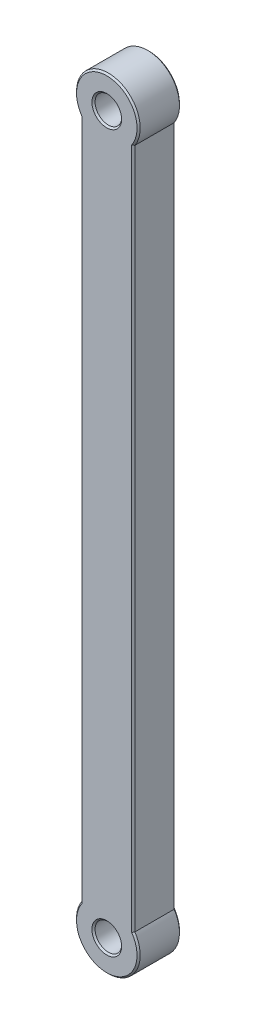
ISO-10303-21;
HEADER;
FILE_DESCRIPTION(('STEP AP214'),'2;1');
FILE_NAME('part.step','',(''),(''),'','','');
FILE_SCHEMA(('AUTOMOTIVE_DESIGN { 1 0 10303 214 1 1 1 1 }'));
ENDSEC;
DATA;
#1=APPLICATION_CONTEXT('core data for automotive mechanical design processes');
#2=APPLICATION_PROTOCOL_DEFINITION('international standard','automotive_design',2000,#1);
#3=PRODUCT_CONTEXT('',#1,'mechanical');
#4=PRODUCT('Part','Part','',(#3));
#5=PRODUCT_RELATED_PRODUCT_CATEGORY('part','',(#4));
#6=PRODUCT_DEFINITION_FORMATION('','',#4);
#7=PRODUCT_DEFINITION_CONTEXT('part definition',#1,'design');
#8=PRODUCT_DEFINITION('design','',#6,#7);
#9=PRODUCT_DEFINITION_SHAPE('','',#8);
#10=(LENGTH_UNIT() NAMED_UNIT(*) SI_UNIT(.MILLI.,.METRE.));
#11=(NAMED_UNIT(*) PLANE_ANGLE_UNIT() SI_UNIT($,.RADIAN.));
#12=(NAMED_UNIT(*) SI_UNIT($,.STERADIAN.) SOLID_ANGLE_UNIT());
#13=UNCERTAINTY_MEASURE_WITH_UNIT(LENGTH_MEASURE(1.E-05),#10,'distance_accuracy_value','');
#14=(GEOMETRIC_REPRESENTATION_CONTEXT(3) GLOBAL_UNCERTAINTY_ASSIGNED_CONTEXT((#13)) GLOBAL_UNIT_ASSIGNED_CONTEXT((#10,
#11,#12)) REPRESENTATION_CONTEXT('',''));
#15=CARTESIAN_POINT('',(0.,0.,0.));
#16=DIRECTION('',(0.,0.,1.));
#17=DIRECTION('',(1.,0.,0.));
#18=AXIS2_PLACEMENT_3D('',#15,#16,#17);
#19=CARTESIAN_POINT('',(5.,0.,8.));
#20=DIRECTION('',(-1.,0.,0.));
#21=DIRECTION('',(0.,0.,1.));
#22=AXIS2_PLACEMENT_3D('',#19,#20,#21);
#23=PLANE('',#22);
#24=DIRECTION('',(0.,0.,-1.));
#25=VECTOR('',#24,1.);
#26=CARTESIAN_POINT('',(5.,3.3166247903554,24.9705627484771));
#27=LINE('',#26,#25);
#28=CARTESIAN_POINT('',(5.,3.3166247903554,0.299999999999995));
#29=VERTEX_POINT('',#28);
#30=CARTESIAN_POINT('',(5.,3.3166247903554,7.69999999999999));
#31=VERTEX_POINT('',#30);
#32=EDGE_CURVE('E139',#29,#31,#27,.F.);
#33=ORIENTED_EDGE('',*,*,#32,.F.);
#34=DIRECTION('',(0.,1.,0.));
#35=VECTOR('',#34,1.);
#36=CARTESIAN_POINT('',(5.,0.,0.299999999999995));
#37=LINE('',#36,#35);
#38=CARTESIAN_POINT('',(5.,131.683375209645,0.299999999999995));
#39=VERTEX_POINT('',#38);
#40=EDGE_CURVE('E124',#29,#39,#37,.T.);
#41=ORIENTED_EDGE('',*,*,#40,.T.);
#42=DIRECTION('',(0.,0.,-1.));
#43=VECTOR('',#42,1.);
#44=CARTESIAN_POINT('',(5.,131.683375209645,24.9705627484771));
#45=LINE('',#44,#43);
#46=CARTESIAN_POINT('',(5.,131.683375209645,7.69999999999999));
#47=VERTEX_POINT('',#46);
#48=EDGE_CURVE('E150',#47,#39,#45,.T.);
#49=ORIENTED_EDGE('',*,*,#48,.F.);
#50=DIRECTION('',(0.,-1.,0.));
#51=VECTOR('',#50,1.);
#52=CARTESIAN_POINT('',(5.,3.3166247903554,7.69999999999999));
#53=LINE('',#52,#51);
#54=EDGE_CURVE('E133',#47,#31,#53,.T.);
#55=ORIENTED_EDGE('',*,*,#54,.T.);
#56=EDGE_LOOP('',(#33,#41,#49,#55));
#57=FACE_BOUND('',#56,.T.);
#58=ADVANCED_FACE('F39',(#57),#23,.F.);
#59=CARTESIAN_POINT('',(-5.,0.,8.));
#60=DIRECTION('',(1.,0.,0.));
#61=DIRECTION('',(0.,0.,-1.));
#62=AXIS2_PLACEMENT_3D('',#59,#60,#61);
#63=PLANE('',#62);
#64=DIRECTION('',(0.,0.,-1.));
#65=VECTOR('',#64,1.);
#66=CARTESIAN_POINT('',(-5.,131.683375209645,24.9705627484771));
#67=LINE('',#66,#65);
#68=CARTESIAN_POINT('',(-5.,131.683375209645,0.299999999999995));
#69=VERTEX_POINT('',#68);
#70=CARTESIAN_POINT('',(-5.,131.683375209645,7.69999999999999));
#71=VERTEX_POINT('',#70);
#72=EDGE_CURVE('E437',#69,#71,#67,.F.);
#73=ORIENTED_EDGE('',*,*,#72,.F.);
#74=DIRECTION('',(0.,-1.,0.));
#75=VECTOR('',#74,1.);
#76=CARTESIAN_POINT('',(-5.,0.,0.299999999999995));
#77=LINE('',#76,#75);
#78=CARTESIAN_POINT('',(-5.,3.3166247903554,0.299999999999995));
#79=VERTEX_POINT('',#78);
#80=EDGE_CURVE('E172',#69,#79,#77,.T.);
#81=ORIENTED_EDGE('',*,*,#80,.T.);
#82=DIRECTION('',(0.,0.,-1.));
#83=VECTOR('',#82,1.);
#84=CARTESIAN_POINT('',(-5.,3.3166247903554,24.9705627484771));
#85=LINE('',#84,#83);
#86=CARTESIAN_POINT('',(-5.,3.3166247903554,7.69999999999999));
#87=VERTEX_POINT('',#86);
#88=EDGE_CURVE('E141',#87,#79,#85,.T.);
#89=ORIENTED_EDGE('',*,*,#88,.F.);
#90=DIRECTION('',(0.,1.,0.));
#91=VECTOR('',#90,1.);
#92=CARTESIAN_POINT('',(-5.,131.683375209645,7.69999999999999));
#93=LINE('',#92,#91);
#94=EDGE_CURVE('E170',#87,#71,#93,.T.);
#95=ORIENTED_EDGE('',*,*,#94,.T.);
#96=EDGE_LOOP('',(#73,#81,#89,#95));
#97=FACE_BOUND('',#96,.T.);
#98=ADVANCED_FACE('F313',(#97),#63,.F.);
#99=CARTESIAN_POINT('',(0.,0.,8.));
#100=DIRECTION('',(0.,0.,1.));
#101=DIRECTION('',(1.,0.,0.));
#102=AXIS2_PLACEMENT_3D('',#99,#100,#101);
#103=PLANE('',#102);
#104=CARTESIAN_POINT('',(0.,0.,8.));
#105=DIRECTION('',(0.,0.,1.));
#106=DIRECTION('',(1.,0.,0.));
#107=AXIS2_PLACEMENT_3D('',#104,#105,#106);
#108=CIRCLE('',#107,5.69999999999998);
#109=CARTESIAN_POINT('',(-4.69999999999998,3.22490309931942,8.));
#110=VERTEX_POINT('',#109);
#111=CARTESIAN_POINT('',(4.69999999999998,3.22490309931942,8.));
#112=VERTEX_POINT('',#111);
#113=EDGE_CURVE('E55',#110,#112,#108,.T.);
#114=ORIENTED_EDGE('',*,*,#113,.T.);
#115=DIRECTION('',(0.,1.,0.));
#116=VECTOR('',#115,1.);
#117=CARTESIAN_POINT('',(4.69999999999998,131.683375209645,8.));
#118=LINE('',#117,#116);
#119=CARTESIAN_POINT('',(4.69999999999998,131.775096900681,8.));
#120=VERTEX_POINT('',#119);
#121=EDGE_CURVE('E11',#112,#120,#118,.T.);
#122=ORIENTED_EDGE('',*,*,#121,.T.);
#123=CARTESIAN_POINT('',(0.,135.,8.));
#124=DIRECTION('',(0.,0.,1.));
#125=DIRECTION('',(1.,0.,0.));
#126=AXIS2_PLACEMENT_3D('',#123,#124,#125);
#127=CIRCLE('',#126,5.69999999999998);
#128=CARTESIAN_POINT('',(-4.69999999999998,131.775096900681,8.));
#129=VERTEX_POINT('',#128);
#130=EDGE_CURVE('E192',#120,#129,#127,.T.);
#131=ORIENTED_EDGE('',*,*,#130,.T.);
#132=DIRECTION('',(0.,-1.,0.));
#133=VECTOR('',#132,1.);
#134=CARTESIAN_POINT('',(-4.69999999999998,3.3166247903554,8.));
#135=LINE('',#134,#133);
#136=EDGE_CURVE('E66',#129,#110,#135,.T.);
#137=ORIENTED_EDGE('',*,*,#136,.T.);
#138=EDGE_LOOP('',(#114,#122,#131,#137));
#139=FACE_BOUND('',#138,.T.);
#140=CARTESIAN_POINT('',(0.,0.,8.));
#141=DIRECTION('',(0.,0.,1.));
#142=DIRECTION('',(1.,0.,0.));
#143=AXIS2_PLACEMENT_3D('',#140,#141,#142);
#144=CIRCLE('',#143,2.79999999999998);
#145=CARTESIAN_POINT('',(2.79999999999998,0.,8.));
#146=VERTEX_POINT('',#145);
#147=EDGE_CURVE('E189',#146,#146,#144,.F.);
#148=ORIENTED_EDGE('',*,*,#147,.T.);
#149=EDGE_LOOP('',(#148));
#150=FACE_BOUND('',#149,.T.);
#151=CARTESIAN_POINT('',(3.06005221162309E-12,135.,8.));
#152=DIRECTION('',(0.,0.,1.));
#153=DIRECTION('',(1.,0.,0.));
#154=AXIS2_PLACEMENT_3D('',#151,#152,#153);
#155=CIRCLE('',#154,2.8000000000018);
#156=CARTESIAN_POINT('',(2.80000000000486,135.,8.));
#157=VERTEX_POINT('',#156);
#158=EDGE_CURVE('E186',#157,#157,#155,.F.);
#159=ORIENTED_EDGE('',*,*,#158,.T.);
#160=EDGE_LOOP('',(#159));
#161=FACE_BOUND('',#160,.T.);
#162=ADVANCED_FACE('F317',(#139,#150,#161),#103,.T.);
#163=CARTESIAN_POINT('',(0.,0.,0.));
#164=DIRECTION('',(0.,0.,1.));
#165=DIRECTION('',(1.,0.,0.));
#166=AXIS2_PLACEMENT_3D('',#163,#164,#165);
#167=PLANE('',#166);
#168=DIRECTION('',(0.,-1.,0.));
#169=VECTOR('',#168,1.);
#170=CARTESIAN_POINT('',(4.70000000000001,0.,0.));
#171=LINE('',#170,#169);
#172=CARTESIAN_POINT('',(4.7,131.775096900681,0.));
#173=VERTEX_POINT('',#172);
#174=CARTESIAN_POINT('',(4.70000000000001,3.22490309931942,0.));
#175=VERTEX_POINT('',#174);
#176=EDGE_CURVE('E163',#173,#175,#171,.T.);
#177=ORIENTED_EDGE('',*,*,#176,.T.);
#178=CARTESIAN_POINT('',(0.,0.,0.));
#179=DIRECTION('',(0.,0.,1.));
#180=DIRECTION('',(1.,0.,0.));
#181=AXIS2_PLACEMENT_3D('',#178,#179,#180);
#182=CIRCLE('',#181,5.70000000000001);
#183=CARTESIAN_POINT('',(-4.70000000000001,3.22490309931942,0.));
#184=VERTEX_POINT('',#183);
#185=EDGE_CURVE('E118',#175,#184,#182,.F.);
#186=ORIENTED_EDGE('',*,*,#185,.T.);
#187=DIRECTION('',(0.,1.,0.));
#188=VECTOR('',#187,1.);
#189=CARTESIAN_POINT('',(-4.70000000000001,0.,0.));
#190=LINE('',#189,#188);
#191=CARTESIAN_POINT('',(-4.70000000000001,131.775096900681,0.));
#192=VERTEX_POINT('',#191);
#193=EDGE_CURVE('E159',#184,#192,#190,.T.);
#194=ORIENTED_EDGE('',*,*,#193,.T.);
#195=CARTESIAN_POINT('',(0.,135.,0.));
#196=DIRECTION('',(0.,0.,1.));
#197=DIRECTION('',(1.,0.,0.));
#198=AXIS2_PLACEMENT_3D('',#195,#196,#197);
#199=CIRCLE('',#198,5.70000000000001);
#200=EDGE_CURVE('E161',#192,#173,#199,.F.);
#201=ORIENTED_EDGE('',*,*,#200,.T.);
#202=EDGE_LOOP('',(#177,#186,#194,#201));
#203=FACE_BOUND('',#202,.T.);
#204=CARTESIAN_POINT('',(0.,0.,0.));
#205=DIRECTION('',(0.,0.,1.));
#206=DIRECTION('',(1.,0.,0.));
#207=AXIS2_PLACEMENT_3D('',#204,#205,#206);
#208=CIRCLE('',#207,2.80000000000001);
#209=CARTESIAN_POINT('',(2.80000000000001,0.,0.));
#210=VERTEX_POINT('',#209);
#211=EDGE_CURVE('E156',#210,#210,#208,.T.);
#212=ORIENTED_EDGE('',*,*,#211,.T.);
#213=EDGE_LOOP('',(#212));
#214=FACE_BOUND('',#213,.T.);
#215=CARTESIAN_POINT('',(3.06005221162309E-12,135.,0.));
#216=DIRECTION('',(0.,0.,1.));
#217=DIRECTION('',(1.,0.,0.));
#218=AXIS2_PLACEMENT_3D('',#215,#216,#217);
#219=CIRCLE('',#218,2.80000000000181);
#220=CARTESIAN_POINT('',(2.80000000000488,135.,0.));
#221=VERTEX_POINT('',#220);
#222=EDGE_CURVE('E143',#221,#221,#219,.T.);
#223=ORIENTED_EDGE('',*,*,#222,.T.);
#224=EDGE_LOOP('',(#223));
#225=FACE_BOUND('',#224,.T.);
#226=ADVANCED_FACE('F321',(#203,#214,#225),#167,.F.);
#227=CARTESIAN_POINT('',(0.,0.,24.9705627484771));
#228=DIRECTION('',(0.,0.,-1.));
#229=DIRECTION('',(-1.,0.,0.));
#230=AXIS2_PLACEMENT_3D('',#227,#228,#229);
#231=CYLINDRICAL_SURFACE('',#230,6.);
#232=ORIENTED_EDGE('',*,*,#88,.T.);
#233=CARTESIAN_POINT('',(0.,0.,0.299999999999995));
#234=DIRECTION('',(0.,0.,1.));
#235=DIRECTION('',(1.,0.,0.));
#236=AXIS2_PLACEMENT_3D('',#233,#234,#235);
#237=CIRCLE('',#236,6.);
#238=EDGE_CURVE('E116',#79,#29,#237,.T.);
#239=ORIENTED_EDGE('',*,*,#238,.T.);
#240=ORIENTED_EDGE('',*,*,#32,.T.);
#241=CARTESIAN_POINT('',(0.,0.,7.69999999999999));
#242=DIRECTION('',(0.,0.,1.));
#243=DIRECTION('',(1.,0.,0.));
#244=AXIS2_PLACEMENT_3D('',#241,#242,#243);
#245=CIRCLE('',#244,6.);
#246=EDGE_CURVE('E144',#31,#87,#245,.F.);
#247=ORIENTED_EDGE('',*,*,#246,.T.);
#248=EDGE_LOOP('',(#232,#239,#240,#247));
#249=FACE_BOUND('',#248,.T.);
#250=ADVANCED_FACE('F138',(#249),#231,.T.);
#251=CARTESIAN_POINT('',(0.,135.,24.9705627484771));
#252=DIRECTION('',(0.,0.,-1.));
#253=DIRECTION('',(-1.,0.,0.));
#254=AXIS2_PLACEMENT_3D('',#251,#252,#253);
#255=CYLINDRICAL_SURFACE('',#254,6.);
#256=ORIENTED_EDGE('',*,*,#48,.T.);
#257=CARTESIAN_POINT('',(0.,135.,0.299999999999995));
#258=DIRECTION('',(0.,0.,1.));
#259=DIRECTION('',(1.,0.,0.));
#260=AXIS2_PLACEMENT_3D('',#257,#258,#259);
#261=CIRCLE('',#260,6.);
#262=EDGE_CURVE('E168',#39,#69,#261,.T.);
#263=ORIENTED_EDGE('',*,*,#262,.T.);
#264=ORIENTED_EDGE('',*,*,#72,.T.);
#265=CARTESIAN_POINT('',(0.,135.,7.69999999999999));
#266=DIRECTION('',(0.,0.,1.));
#267=DIRECTION('',(1.,0.,0.));
#268=AXIS2_PLACEMENT_3D('',#265,#266,#267);
#269=CIRCLE('',#268,6.);
#270=EDGE_CURVE('E132',#71,#47,#269,.F.);
#271=ORIENTED_EDGE('',*,*,#270,.T.);
#272=EDGE_LOOP('',(#256,#263,#264,#271));
#273=FACE_BOUND('',#272,.T.);
#274=ADVANCED_FACE('F329',(#273),#255,.T.);
#275=CARTESIAN_POINT('',(0.,0.,8.));
#276=DIRECTION('',(0.,0.,-1.));
#277=DIRECTION('',(-1.,0.,0.));
#278=AXIS2_PLACEMENT_3D('',#275,#276,#277);
#279=CYLINDRICAL_SURFACE('',#278,2.5);
#280=CARTESIAN_POINT('',(0.,0.,0.300000000000019));
#281=DIRECTION('',(0.,0.,1.));
#282=DIRECTION('',(1.,0.,0.));
#283=AXIS2_PLACEMENT_3D('',#280,#281,#282);
#284=CIRCLE('',#283,2.5);
#285=CARTESIAN_POINT('',(2.5,0.,0.300000000000019));
#286=VERTEX_POINT('',#285);
#287=EDGE_CURVE('E177',#286,#286,#284,.F.);
#288=ORIENTED_EDGE('',*,*,#287,.T.);
#289=EDGE_LOOP('',(#288));
#290=FACE_BOUND('',#289,.T.);
#291=CARTESIAN_POINT('',(0.,0.,7.70000000000001));
#292=DIRECTION('',(0.,0.,1.));
#293=DIRECTION('',(1.,0.,0.));
#294=AXIS2_PLACEMENT_3D('',#291,#292,#293);
#295=CIRCLE('',#294,2.5);
#296=CARTESIAN_POINT('',(2.5,0.,7.70000000000001));
#297=VERTEX_POINT('',#296);
#298=EDGE_CURVE('E174',#297,#297,#295,.T.);
#299=ORIENTED_EDGE('',*,*,#298,.T.);
#300=EDGE_LOOP('',(#299));
#301=FACE_BOUND('',#300,.T.);
#302=ADVANCED_FACE('F332',(#290,#301),#279,.F.);
#303=CARTESIAN_POINT('',(3.06005221162309E-12,135.,8.));
#304=DIRECTION('',(0.,0.,-1.));
#305=DIRECTION('',(-1.,0.,0.));
#306=AXIS2_PLACEMENT_3D('',#303,#304,#305);
#307=CYLINDRICAL_SURFACE('',#306,2.50000000000182);
#308=CARTESIAN_POINT('',(3.06005221162309E-12,135.,0.300000000000003));
#309=DIRECTION('',(0.,0.,1.));
#310=DIRECTION('',(1.,0.,0.));
#311=AXIS2_PLACEMENT_3D('',#308,#309,#310);
#312=CIRCLE('',#311,2.50000000000182);
#313=CARTESIAN_POINT('',(2.50000000000488,135.,0.300000000000003));
#314=VERTEX_POINT('',#313);
#315=EDGE_CURVE('E183',#314,#314,#312,.F.);
#316=ORIENTED_EDGE('',*,*,#315,.T.);
#317=EDGE_LOOP('',(#316));
#318=FACE_BOUND('',#317,.T.);
#319=CARTESIAN_POINT('',(3.06005221162309E-12,135.,7.70000000000002));
#320=DIRECTION('',(0.,0.,1.));
#321=DIRECTION('',(1.,0.,0.));
#322=AXIS2_PLACEMENT_3D('',#319,#320,#321);
#323=CIRCLE('',#322,2.50000000000182);
#324=CARTESIAN_POINT('',(2.50000000000488,135.,7.70000000000002));
#325=VERTEX_POINT('',#324);
#326=EDGE_CURVE('E180',#325,#325,#323,.T.);
#327=ORIENTED_EDGE('',*,*,#326,.T.);
#328=EDGE_LOOP('',(#327));
#329=FACE_BOUND('',#328,.T.);
#330=ADVANCED_FACE('F239',(#318,#329),#307,.F.);
#331=CARTESIAN_POINT('',(0.,135.,0.299999999999995));
#332=DIRECTION('',(0.,0.,1.));
#333=DIRECTION('',(1.,0.,0.));
#334=AXIS2_PLACEMENT_3D('',#331,#332,#333);
#335=CONICAL_SURFACE('',#334,6.,0.785398163397443);
#336=CARTESIAN_POINT('',(5.,131.683375209645,0.299999999999995));
#337=CARTESIAN_POINT('',(4.94996870034109,131.698457392154,0.249968700341085));
#338=CARTESIAN_POINT('',(4.89995305185478,131.713641957245,0.199953051854774));
#339=CARTESIAN_POINT('',(4.79995305185142,131.744215854235,0.0999530518514099));
#340=CARTESIAN_POINT('',(4.74996870033773,131.759605186156,0.0499687003377232));
#341=CARTESIAN_POINT('',(4.70000000000001,131.775096900681,0.));
#342=B_SPLINE_CURVE_WITH_KNOTS('',3,(#336,#337,#338,#339,#340,#341),.UNSPECIFIED.,.F.,.F.,(4,2,
4),(0.,0.217032971771938,0.434065966878987),.UNSPECIFIED.);
#343=EDGE_CURVE('E127',#173,#39,#342,.F.);
#344=ORIENTED_EDGE('',*,*,#343,.F.);
#345=ORIENTED_EDGE('',*,*,#200,.F.);
#346=CARTESIAN_POINT('',(-5.,131.683375209645,0.299999999999995));
#347=CARTESIAN_POINT('',(-4.94996870034109,131.698457392154,0.249968700341085));
#348=CARTESIAN_POINT('',(-4.89995305185478,131.713641957245,0.199953051854773));
#349=CARTESIAN_POINT('',(-4.79995305185142,131.744215854235,0.0999530518514076));
#350=CARTESIAN_POINT('',(-4.74996870033773,131.759605186156,0.0499687003377202));
#351=CARTESIAN_POINT('',(-4.7,131.775096900681,0.));
#352=B_SPLINE_CURVE_WITH_KNOTS('',3,(#346,#347,#348,#349,#350,#351),.UNSPECIFIED.,.F.,.F.,(4,2,
4),(0.,0.21703297177194,0.434065966878992),.UNSPECIFIED.);
#353=EDGE_CURVE('E226',#69,#192,#352,.T.);
#354=ORIENTED_EDGE('',*,*,#353,.F.);
#355=ORIENTED_EDGE('',*,*,#262,.F.);
#356=EDGE_LOOP('',(#344,#345,#354,#355));
#357=FACE_BOUND('',#356,.T.);
#358=ADVANCED_FACE('F233',(#357),#335,.T.);
#359=CARTESIAN_POINT('',(-5.,0.,0.299999999999995));
#360=DIRECTION('',(0.707106781186547,0.,0.707106781186547));
#361=DIRECTION('',(0.,-1.,0.));
#362=AXIS2_PLACEMENT_3D('',#359,#360,#361);
#363=PLANE('',#362);
#364=ORIENTED_EDGE('',*,*,#353,.T.);
#365=ORIENTED_EDGE('',*,*,#193,.F.);
#366=CARTESIAN_POINT('',(-4.7,3.22490309931942,0.));
#367=CARTESIAN_POINT('',(-4.74996870033773,3.24039481384446,0.0499687003377218));
#368=CARTESIAN_POINT('',(-4.79995305185141,3.25578414576537,0.0999530518514078));
#369=CARTESIAN_POINT('',(-4.89995305185478,3.28635804275535,0.199953051854771));
#370=CARTESIAN_POINT('',(-4.94996870034109,3.30154260784643,0.249968700341083));
#371=CARTESIAN_POINT('',(-5.,3.3166247903554,0.299999999999994));
#372=B_SPLINE_CURVE_WITH_KNOTS('',3,(#366,#367,#368,#369,#370,#371),.UNSPECIFIED.,.F.,.F.,(4,2,
4),(0.,0.217032995107051,0.434065966878991),.UNSPECIFIED.);
#373=EDGE_CURVE('E121',#79,#184,#372,.F.);
#374=ORIENTED_EDGE('',*,*,#373,.F.);
#375=ORIENTED_EDGE('',*,*,#80,.F.);
#376=EDGE_LOOP('',(#364,#365,#374,#375));
#377=FACE_BOUND('',#376,.T.);
#378=ADVANCED_FACE('F217',(#377),#363,.F.);
#379=CARTESIAN_POINT('',(5.,0.,0.299999999999995));
#380=DIRECTION('',(-0.707106781186547,0.,0.707106781186547));
#381=DIRECTION('',(0.,1.,0.));
#382=AXIS2_PLACEMENT_3D('',#379,#380,#381);
#383=PLANE('',#382);
#384=ORIENTED_EDGE('',*,*,#343,.T.);
#385=ORIENTED_EDGE('',*,*,#40,.F.);
#386=CARTESIAN_POINT('',(5.,3.3166247903554,0.299999999999995));
#387=CARTESIAN_POINT('',(4.94996870034109,3.30154260784642,0.249968700341084));
#388=CARTESIAN_POINT('',(4.89995305185478,3.28635804275535,0.199953051854772));
#389=CARTESIAN_POINT('',(4.79995305185142,3.25578414576538,0.0999530518514081));
#390=CARTESIAN_POINT('',(4.74996870033773,3.24039481384446,0.0499687003377215));
#391=CARTESIAN_POINT('',(4.70000000000001,3.22490309931943,0.));
#392=B_SPLINE_CURVE_WITH_KNOTS('',3,(#386,#387,#388,#389,#390,#391),.UNSPECIFIED.,.F.,.F.,(4,2,
4),(0.,0.217032971771939,0.434065966878991),.UNSPECIFIED.);
#393=EDGE_CURVE('E112',#175,#29,#392,.F.);
#394=ORIENTED_EDGE('',*,*,#393,.F.);
#395=ORIENTED_EDGE('',*,*,#176,.F.);
#396=EDGE_LOOP('',(#384,#385,#394,#395));
#397=FACE_BOUND('',#396,.T.);
#398=ADVANCED_FACE('F125',(#397),#383,.F.);
#399=CARTESIAN_POINT('',(0.,0.,0.299999999999995));
#400=DIRECTION('',(0.,0.,1.));
#401=DIRECTION('',(1.,0.,0.));
#402=AXIS2_PLACEMENT_3D('',#399,#400,#401);
#403=CONICAL_SURFACE('',#402,6.,0.785398163397448);
#404=ORIENTED_EDGE('',*,*,#373,.T.);
#405=ORIENTED_EDGE('',*,*,#185,.F.);
#406=ORIENTED_EDGE('',*,*,#393,.T.);
#407=ORIENTED_EDGE('',*,*,#238,.F.);
#408=EDGE_LOOP('',(#404,#405,#406,#407));
#409=FACE_BOUND('',#408,.T.);
#410=ADVANCED_FACE('F114',(#409),#403,.T.);
#411=CARTESIAN_POINT('',(0.,0.,0.300000000000019));
#412=DIRECTION('',(0.,0.,-1.));
#413=DIRECTION('',(-1.,0.,0.));
#414=AXIS2_PLACEMENT_3D('',#411,#412,#413);
#415=CONICAL_SURFACE('',#414,2.5,0.785398163397434);
#416=ORIENTED_EDGE('',*,*,#211,.F.);
#417=EDGE_LOOP('',(#416));
#418=FACE_BOUND('',#417,.T.);
#419=ORIENTED_EDGE('',*,*,#287,.F.);
#420=EDGE_LOOP('',(#419));
#421=FACE_BOUND('',#420,.T.);
#422=ADVANCED_FACE('F242',(#418,#421),#415,.F.);
#423=CARTESIAN_POINT('',(3.06005221162309E-12,135.,0.300000000000003));
#424=DIRECTION('',(0.,0.,-1.));
#425=DIRECTION('',(-1.,0.,0.));
#426=AXIS2_PLACEMENT_3D('',#423,#424,#425);
#427=CONICAL_SURFACE('',#426,2.50000000000182,0.785398163397435);
#428=ORIENTED_EDGE('',*,*,#222,.F.);
#429=EDGE_LOOP('',(#428));
#430=FACE_BOUND('',#429,.T.);
#431=ORIENTED_EDGE('',*,*,#315,.F.);
#432=EDGE_LOOP('',(#431));
#433=FACE_BOUND('',#432,.T.);
#434=ADVANCED_FACE('F249',(#430,#433),#427,.F.);
#435=CARTESIAN_POINT('',(-4.69999999999998,0.,8.));
#436=DIRECTION('',(-0.707106781186535,0.,0.70710678118656));
#437=DIRECTION('',(0.,1.,0.));
#438=AXIS2_PLACEMENT_3D('',#435,#436,#437);
#439=PLANE('',#438);
#440=CARTESIAN_POINT('',(-5.,131.683375209645,7.69999999999999));
#441=CARTESIAN_POINT('',(-4.94996870034108,131.698457392154,7.7500312996589));
#442=CARTESIAN_POINT('',(-4.89995305185477,131.713641957245,7.80004694814522));
#443=CARTESIAN_POINT('',(-4.7999530518514,131.744215854235,7.90004694814859));
#444=CARTESIAN_POINT('',(-4.74996870033771,131.759605186156,7.95003129966228));
#445=CARTESIAN_POINT('',(-4.69999999999998,131.775096900681,8.));
#446=B_SPLINE_CURVE_WITH_KNOTS('',3,(#440,#441,#442,#443,#444,#445),.UNSPECIFIED.,.F.,.F.,(4,2,
4),(0.,0.217032971771958,0.434065966879024),.UNSPECIFIED.);
#447=EDGE_CURVE('E283',#71,#129,#446,.T.);
#448=ORIENTED_EDGE('',*,*,#447,.F.);
#449=ORIENTED_EDGE('',*,*,#94,.F.);
#450=CARTESIAN_POINT('',(-5.,3.3166247903554,7.69999999999999));
#451=CARTESIAN_POINT('',(-4.94996870034109,3.30154260784642,7.7500312996589));
#452=CARTESIAN_POINT('',(-4.89995305185477,3.28635804275535,7.80004694814522));
#453=CARTESIAN_POINT('',(-4.7999530518514,3.25578414576537,7.90004694814859));
#454=CARTESIAN_POINT('',(-4.74996870033771,3.24039481384445,7.95003129966228));
#455=CARTESIAN_POINT('',(-4.69999999999998,3.22490309931942,8.));
#456=B_SPLINE_CURVE_WITH_KNOTS('',3,(#450,#451,#452,#453,#454,#455),.UNSPECIFIED.,.F.,.F.,(4,2,
4),(0.,0.217032971771955,0.434065966879023),.UNSPECIFIED.);
#457=EDGE_CURVE('E44',#110,#87,#456,.F.);
#458=ORIENTED_EDGE('',*,*,#457,.F.);
#459=ORIENTED_EDGE('',*,*,#136,.F.);
#460=EDGE_LOOP('',(#448,#449,#458,#459));
#461=FACE_BOUND('',#460,.T.);
#462=ADVANCED_FACE('F256',(#461),#439,.T.);
#463=CARTESIAN_POINT('',(0.,0.,8.));
#464=DIRECTION('',(0.,0.,-1.));
#465=DIRECTION('',(-1.,0.,0.));
#466=AXIS2_PLACEMENT_3D('',#463,#464,#465);
#467=CONICAL_SURFACE('',#466,5.69999999999998,0.785398163397466);
#468=ORIENTED_EDGE('',*,*,#457,.T.);
#469=ORIENTED_EDGE('',*,*,#246,.F.);
#470=CARTESIAN_POINT('',(5.,3.3166247903554,7.69999999999999));
#471=CARTESIAN_POINT('',(4.94996870034109,3.30154260784642,7.7500312996589));
#472=CARTESIAN_POINT('',(4.89995305185477,3.28635804275535,7.80004694814522));
#473=CARTESIAN_POINT('',(4.7999530518514,3.25578414576537,7.90004694814859));
#474=CARTESIAN_POINT('',(4.74996870033771,3.24039481384445,7.95003129966228));
#475=CARTESIAN_POINT('',(4.69999999999998,3.22490309931942,8.));
#476=B_SPLINE_CURVE_WITH_KNOTS('',3,(#470,#471,#472,#473,#474,#475),.UNSPECIFIED.,.F.,.F.,(4,2,
4),(0.,0.217032971771955,0.434065966879023),.UNSPECIFIED.);
#477=EDGE_CURVE('E278',#112,#31,#476,.F.);
#478=ORIENTED_EDGE('',*,*,#477,.F.);
#479=ORIENTED_EDGE('',*,*,#113,.F.);
#480=EDGE_LOOP('',(#468,#469,#478,#479));
#481=FACE_BOUND('',#480,.T.);
#482=ADVANCED_FACE('F289',(#481),#467,.T.);
#483=CARTESIAN_POINT('',(0.,135.,8.));
#484=DIRECTION('',(0.,0.,-1.));
#485=DIRECTION('',(-1.,0.,0.));
#486=AXIS2_PLACEMENT_3D('',#483,#484,#485);
#487=CONICAL_SURFACE('',#486,5.69999999999998,0.78539816339746);
#488=ORIENTED_EDGE('',*,*,#447,.T.);
#489=ORIENTED_EDGE('',*,*,#130,.F.);
#490=CARTESIAN_POINT('',(4.69999999999998,131.775096900681,8.));
#491=CARTESIAN_POINT('',(4.74996870033771,131.759605186156,7.95003129966228));
#492=CARTESIAN_POINT('',(4.7999530518514,131.744215854235,7.90004694814859));
#493=CARTESIAN_POINT('',(4.89995305185477,131.713641957245,7.80004694814522));
#494=CARTESIAN_POINT('',(4.94996870034109,131.698457392154,7.7500312996589));
#495=CARTESIAN_POINT('',(5.,131.683375209645,7.69999999999999));
#496=B_SPLINE_CURVE_WITH_KNOTS('',3,(#490,#491,#492,#493,#494,#495),.UNSPECIFIED.,.F.,.F.,(4,2,
4),(0.,0.217032995107069,0.434065966879028),.UNSPECIFIED.);
#497=EDGE_CURVE('E272',#47,#120,#496,.F.);
#498=ORIENTED_EDGE('',*,*,#497,.F.);
#499=ORIENTED_EDGE('',*,*,#270,.F.);
#500=EDGE_LOOP('',(#488,#489,#498,#499));
#501=FACE_BOUND('',#500,.T.);
#502=ADVANCED_FACE('F268',(#501),#487,.T.);
#503=CARTESIAN_POINT('',(4.69999999999998,0.,8.));
#504=DIRECTION('',(0.707106781186535,0.,0.70710678118656));
#505=DIRECTION('',(0.,-1.,0.));
#506=AXIS2_PLACEMENT_3D('',#503,#504,#505);
#507=PLANE('',#506);
#508=ORIENTED_EDGE('',*,*,#477,.T.);
#509=ORIENTED_EDGE('',*,*,#54,.F.);
#510=ORIENTED_EDGE('',*,*,#497,.T.);
#511=ORIENTED_EDGE('',*,*,#121,.F.);
#512=EDGE_LOOP('',(#508,#509,#510,#511));
#513=FACE_BOUND('',#512,.T.);
#514=ADVANCED_FACE('F259',(#513),#507,.T.);
#515=CARTESIAN_POINT('',(0.,0.,8.));
#516=DIRECTION('',(0.,0.,1.));
#517=DIRECTION('',(1.,0.,0.));
#518=AXIS2_PLACEMENT_3D('',#515,#516,#517);
#519=CONICAL_SURFACE('',#518,2.79999999999998,0.785398163397434);
#520=ORIENTED_EDGE('',*,*,#298,.F.);
#521=EDGE_LOOP('',(#520));
#522=FACE_BOUND('',#521,.T.);
#523=ORIENTED_EDGE('',*,*,#147,.F.);
#524=EDGE_LOOP('',(#523));
#525=FACE_BOUND('',#524,.T.);
#526=ADVANCED_FACE('F267',(#522,#525),#519,.F.);
#527=CARTESIAN_POINT('',(3.06005221162309E-12,135.,8.));
#528=DIRECTION('',(0.,0.,1.));
#529=DIRECTION('',(1.,0.,0.));
#530=AXIS2_PLACEMENT_3D('',#527,#528,#529);
#531=CONICAL_SURFACE('',#530,2.8000000000018,0.785398163397458);
#532=ORIENTED_EDGE('',*,*,#326,.F.);
#533=EDGE_LOOP('',(#532));
#534=FACE_BOUND('',#533,.T.);
#535=ORIENTED_EDGE('',*,*,#158,.F.);
#536=EDGE_LOOP('',(#535));
#537=FACE_BOUND('',#536,.T.);
#538=ADVANCED_FACE('F42',(#534,#537),#531,.F.);
#539=CLOSED_SHELL('',(#58,#98,#162,#226,#250,#274,#302,#330,#358,#378,#398,#410,#422,#434,#462,
#482,#502,#514,#526,#538));
#540=MANIFOLD_SOLID_BREP('B2',#539);
#541=ADVANCED_BREP_SHAPE_REPRESENTATION('',(#18,#540),#14);
#542=SHAPE_DEFINITION_REPRESENTATION(#9,#541);
ENDSEC;
END-ISO-10303-21;
